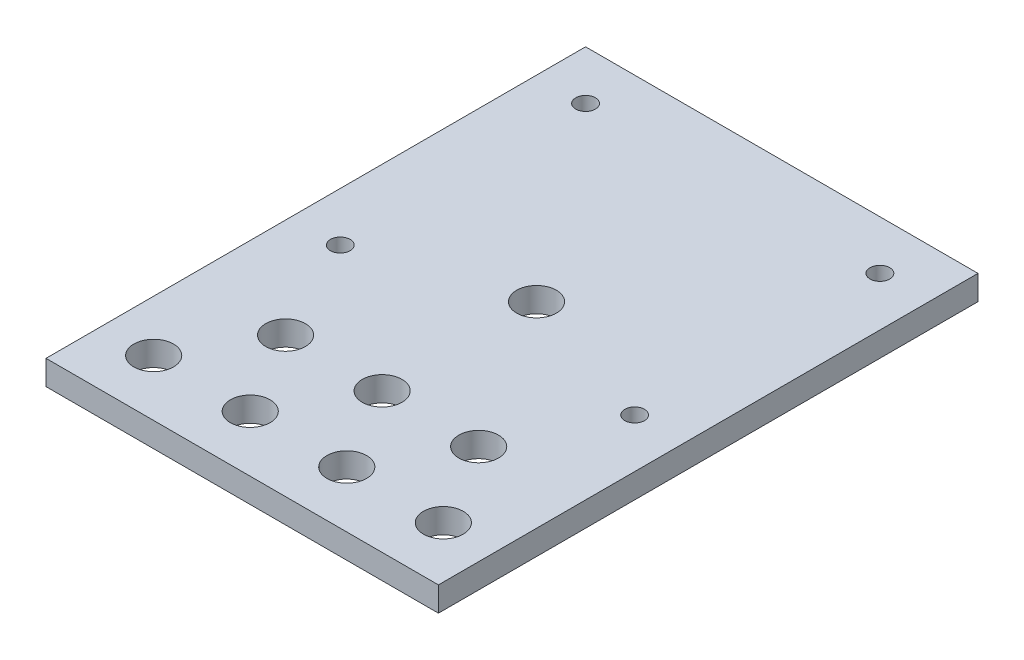
ISO-10303-21;
HEADER;
FILE_DESCRIPTION(('STEP AP214'),'2;1');
FILE_NAME('part.step','',(''),(''),'','','');
FILE_SCHEMA(('AUTOMOTIVE_DESIGN { 1 0 10303 214 1 1 1 1 }'));
ENDSEC;
DATA;
#1=APPLICATION_CONTEXT('core data for automotive mechanical design processes');
#2=APPLICATION_PROTOCOL_DEFINITION('international standard','automotive_design',2000,#1);
#3=PRODUCT_CONTEXT('',#1,'mechanical');
#4=PRODUCT('Part','Part','',(#3));
#5=PRODUCT_RELATED_PRODUCT_CATEGORY('part','',(#4));
#6=PRODUCT_DEFINITION_FORMATION('','',#4);
#7=PRODUCT_DEFINITION_CONTEXT('part definition',#1,'design');
#8=PRODUCT_DEFINITION('design','',#6,#7);
#9=PRODUCT_DEFINITION_SHAPE('','',#8);
#10=(LENGTH_UNIT() NAMED_UNIT(*) SI_UNIT(.MILLI.,.METRE.));
#11=(NAMED_UNIT(*) PLANE_ANGLE_UNIT() SI_UNIT($,.RADIAN.));
#12=(NAMED_UNIT(*) SI_UNIT($,.STERADIAN.) SOLID_ANGLE_UNIT());
#13=UNCERTAINTY_MEASURE_WITH_UNIT(LENGTH_MEASURE(1.E-05),#10,'distance_accuracy_value','');
#14=(GEOMETRIC_REPRESENTATION_CONTEXT(3) GLOBAL_UNCERTAINTY_ASSIGNED_CONTEXT((#13)) GLOBAL_UNIT_ASSIGNED_CONTEXT((#10,
#11,#12)) REPRESENTATION_CONTEXT('',''));
#15=CARTESIAN_POINT('',(0.,0.,0.));
#16=DIRECTION('',(0.,0.,1.));
#17=DIRECTION('',(1.,0.,0.));
#18=AXIS2_PLACEMENT_3D('',#15,#16,#17);
#19=CARTESIAN_POINT('',(0.,6.35,0.));
#20=DIRECTION('',(1.,0.,0.));
#21=DIRECTION('',(0.,0.,-1.));
#22=AXIS2_PLACEMENT_3D('',#19,#20,#21);
#23=PLANE('',#22);
#24=DIRECTION('',(0.,0.,1.));
#25=VECTOR('',#24,1.);
#26=CARTESIAN_POINT('',(0.,0.,0.));
#27=LINE('',#26,#25);
#28=CARTESIAN_POINT('',(0.,0.,-139.7));
#29=VERTEX_POINT('',#28);
#30=CARTESIAN_POINT('',(0.,0.,0.));
#31=VERTEX_POINT('',#30);
#32=EDGE_CURVE('E97',#29,#31,#27,.T.);
#33=ORIENTED_EDGE('',*,*,#32,.T.);
#34=DIRECTION('',(0.,-1.,0.));
#35=VECTOR('',#34,1.);
#36=CARTESIAN_POINT('',(0.,6.35,0.));
#37=LINE('',#36,#35);
#38=CARTESIAN_POINT('',(0.,6.35,0.));
#39=VERTEX_POINT('',#38);
#40=EDGE_CURVE('E11',#39,#31,#37,.T.);
#41=ORIENTED_EDGE('',*,*,#40,.F.);
#42=DIRECTION('',(0.,0.,1.));
#43=VECTOR('',#42,1.);
#44=CARTESIAN_POINT('',(0.,6.35,0.));
#45=LINE('',#44,#43);
#46=CARTESIAN_POINT('',(0.,6.35,-139.7));
#47=VERTEX_POINT('',#46);
#48=EDGE_CURVE('E85',#47,#39,#45,.T.);
#49=ORIENTED_EDGE('',*,*,#48,.F.);
#50=DIRECTION('',(0.,-1.,0.));
#51=VECTOR('',#50,1.);
#52=CARTESIAN_POINT('',(0.,6.35,-139.7));
#53=LINE('',#52,#51);
#54=EDGE_CURVE('E93',#47,#29,#53,.T.);
#55=ORIENTED_EDGE('',*,*,#54,.T.);
#56=EDGE_LOOP('',(#33,#41,#49,#55));
#57=FACE_BOUND('',#56,.T.);
#58=ADVANCED_FACE('F34',(#57),#23,.F.);
#59=CARTESIAN_POINT('',(0.,6.35,0.));
#60=DIRECTION('',(0.,0.,-1.));
#61=DIRECTION('',(-1.,0.,0.));
#62=AXIS2_PLACEMENT_3D('',#59,#60,#61);
#63=PLANE('',#62);
#64=DIRECTION('',(1.,0.,0.));
#65=VECTOR('',#64,1.);
#66=CARTESIAN_POINT('',(0.,0.,0.));
#67=LINE('',#66,#65);
#68=CARTESIAN_POINT('',(101.6,0.,0.));
#69=VERTEX_POINT('',#68);
#70=EDGE_CURVE('E89',#31,#69,#67,.T.);
#71=ORIENTED_EDGE('',*,*,#70,.T.);
#72=DIRECTION('',(0.,-1.,0.));
#73=VECTOR('',#72,1.);
#74=CARTESIAN_POINT('',(101.6,6.35,0.));
#75=LINE('',#74,#73);
#76=CARTESIAN_POINT('',(101.6,6.35,0.));
#77=VERTEX_POINT('',#76);
#78=EDGE_CURVE('E42',#77,#69,#75,.T.);
#79=ORIENTED_EDGE('',*,*,#78,.F.);
#80=DIRECTION('',(1.,0.,0.));
#81=VECTOR('',#80,1.);
#82=CARTESIAN_POINT('',(0.,6.35,0.));
#83=LINE('',#82,#81);
#84=EDGE_CURVE('E80',#39,#77,#83,.T.);
#85=ORIENTED_EDGE('',*,*,#84,.F.);
#86=ORIENTED_EDGE('',*,*,#40,.T.);
#87=EDGE_LOOP('',(#71,#79,#85,#86));
#88=FACE_BOUND('',#87,.T.);
#89=ADVANCED_FACE('F88',(#88),#63,.F.);
#90=CARTESIAN_POINT('',(101.6,6.35,0.));
#91=DIRECTION('',(-1.,0.,0.));
#92=DIRECTION('',(0.,0.,1.));
#93=AXIS2_PLACEMENT_3D('',#90,#91,#92);
#94=PLANE('',#93);
#95=DIRECTION('',(0.,0.,-1.));
#96=VECTOR('',#95,1.);
#97=CARTESIAN_POINT('',(101.6,0.,0.));
#98=LINE('',#97,#96);
#99=CARTESIAN_POINT('',(101.6,0.,-139.7));
#100=VERTEX_POINT('',#99);
#101=EDGE_CURVE('E67',#69,#100,#98,.T.);
#102=ORIENTED_EDGE('',*,*,#101,.T.);
#103=DIRECTION('',(0.,-1.,0.));
#104=VECTOR('',#103,1.);
#105=CARTESIAN_POINT('',(101.6,6.35,-139.7));
#106=LINE('',#105,#104);
#107=CARTESIAN_POINT('',(101.6,6.35,-139.7));
#108=VERTEX_POINT('',#107);
#109=EDGE_CURVE('E90',#108,#100,#106,.T.);
#110=ORIENTED_EDGE('',*,*,#109,.F.);
#111=DIRECTION('',(0.,0.,-1.));
#112=VECTOR('',#111,1.);
#113=CARTESIAN_POINT('',(101.6,6.35,0.));
#114=LINE('',#113,#112);
#115=EDGE_CURVE('E83',#77,#108,#114,.T.);
#116=ORIENTED_EDGE('',*,*,#115,.F.);
#117=ORIENTED_EDGE('',*,*,#78,.T.);
#118=EDGE_LOOP('',(#102,#110,#116,#117));
#119=FACE_BOUND('',#118,.T.);
#120=ADVANCED_FACE('F91',(#119),#94,.F.);
#121=CARTESIAN_POINT('',(0.,6.35,-139.7));
#122=DIRECTION('',(0.,0.,1.));
#123=DIRECTION('',(1.,0.,0.));
#124=AXIS2_PLACEMENT_3D('',#121,#122,#123);
#125=PLANE('',#124);
#126=DIRECTION('',(-1.,0.,0.));
#127=VECTOR('',#126,1.);
#128=CARTESIAN_POINT('',(0.,0.,-139.7));
#129=LINE('',#128,#127);
#130=EDGE_CURVE('E73',#100,#29,#129,.T.);
#131=ORIENTED_EDGE('',*,*,#130,.T.);
#132=ORIENTED_EDGE('',*,*,#54,.F.);
#133=DIRECTION('',(-1.,0.,0.));
#134=VECTOR('',#133,1.);
#135=CARTESIAN_POINT('',(0.,6.35,-139.7));
#136=LINE('',#135,#134);
#137=EDGE_CURVE('E50',#108,#47,#136,.T.);
#138=ORIENTED_EDGE('',*,*,#137,.F.);
#139=ORIENTED_EDGE('',*,*,#109,.T.);
#140=EDGE_LOOP('',(#131,#132,#138,#139));
#141=FACE_BOUND('',#140,.T.);
#142=ADVANCED_FACE('F105',(#141),#125,.F.);
#143=CARTESIAN_POINT('',(0.,6.35,0.));
#144=DIRECTION('',(0.,-1.,0.));
#145=DIRECTION('',(0.,0.,-1.));
#146=AXIS2_PLACEMENT_3D('',#143,#144,#145);
#147=PLANE('',#146);
#148=CARTESIAN_POINT('',(12.7,6.35,-127.));
#149=DIRECTION('',(0.,1.,0.));
#150=DIRECTION('',(0.,0.,1.));
#151=AXIS2_PLACEMENT_3D('',#148,#149,#150);
#152=CIRCLE('',#151,2.55);
#153=CARTESIAN_POINT('',(12.7,6.35,-124.45));
#154=VERTEX_POINT('',#153);
#155=EDGE_CURVE('E141',#154,#154,#152,.T.);
#156=ORIENTED_EDGE('',*,*,#155,.F.);
#157=EDGE_LOOP('',(#156));
#158=FACE_BOUND('',#157,.T.);
#159=CARTESIAN_POINT('',(12.7,6.35,-63.5));
#160=DIRECTION('',(0.,1.,0.));
#161=DIRECTION('',(0.,0.,1.));
#162=AXIS2_PLACEMENT_3D('',#159,#160,#161);
#163=CIRCLE('',#162,2.55);
#164=CARTESIAN_POINT('',(12.7,6.35,-60.95));
#165=VERTEX_POINT('',#164);
#166=EDGE_CURVE('E148',#165,#165,#163,.T.);
#167=ORIENTED_EDGE('',*,*,#166,.F.);
#168=EDGE_LOOP('',(#167));
#169=FACE_BOUND('',#168,.T.);
#170=CARTESIAN_POINT('',(25.8,6.35,-36.2253175473051));
#171=DIRECTION('',(0.,1.,0.));
#172=DIRECTION('',(0.,0.,1.));
#173=AXIS2_PLACEMENT_3D('',#170,#171,#172);
#174=CIRCLE('',#173,5.1435);
#175=CARTESIAN_POINT('',(25.8,6.35,-31.0818175473051));
#176=VERTEX_POINT('',#175);
#177=EDGE_CURVE('E154',#176,#176,#174,.T.);
#178=ORIENTED_EDGE('',*,*,#177,.F.);
#179=EDGE_LOOP('',(#178));
#180=FACE_BOUND('',#179,.T.);
#181=CARTESIAN_POINT('',(50.8,6.35,-36.2253175473055));
#182=DIRECTION('',(0.,1.,0.));
#183=DIRECTION('',(0.,0.,1.));
#184=AXIS2_PLACEMENT_3D('',#181,#182,#183);
#185=CIRCLE('',#184,5.14350000000001);
#186=CARTESIAN_POINT('',(50.8,6.35,-31.0818175473055));
#187=VERTEX_POINT('',#186);
#188=EDGE_CURVE('E160',#187,#187,#185,.T.);
#189=ORIENTED_EDGE('',*,*,#188,.F.);
#190=EDGE_LOOP('',(#189));
#191=FACE_BOUND('',#190,.T.);
#192=CARTESIAN_POINT('',(75.8,6.35,-36.2253175473055));
#193=DIRECTION('',(0.,1.,0.));
#194=DIRECTION('',(0.,0.,1.));
#195=AXIS2_PLACEMENT_3D('',#192,#193,#194);
#196=CIRCLE('',#195,5.1435);
#197=CARTESIAN_POINT('',(75.8,6.35,-31.0818175473055));
#198=VERTEX_POINT('',#197);
#199=EDGE_CURVE('E117',#198,#198,#196,.T.);
#200=ORIENTED_EDGE('',*,*,#199,.F.);
#201=EDGE_LOOP('',(#200));
#202=FACE_BOUND('',#201,.T.);
#203=CARTESIAN_POINT('',(88.3,6.35,-14.5746824526945));
#204=DIRECTION('',(0.,1.,0.));
#205=DIRECTION('',(0.,0.,1.));
#206=AXIS2_PLACEMENT_3D('',#203,#204,#205);
#207=CIRCLE('',#206,5.1435);
#208=CARTESIAN_POINT('',(88.3,6.35,-9.43118245269453));
#209=VERTEX_POINT('',#208);
#210=EDGE_CURVE('E124',#209,#209,#207,.T.);
#211=ORIENTED_EDGE('',*,*,#210,.F.);
#212=EDGE_LOOP('',(#211));
#213=FACE_BOUND('',#212,.T.);
#214=CARTESIAN_POINT('',(63.3,6.35,-14.5746824526945));
#215=DIRECTION('',(0.,1.,0.));
#216=DIRECTION('',(0.,0.,1.));
#217=AXIS2_PLACEMENT_3D('',#214,#215,#216);
#218=CIRCLE('',#217,5.1435);
#219=CARTESIAN_POINT('',(63.3,6.35,-9.43118245269453));
#220=VERTEX_POINT('',#219);
#221=EDGE_CURVE('E130',#220,#220,#218,.T.);
#222=ORIENTED_EDGE('',*,*,#221,.F.);
#223=EDGE_LOOP('',(#222));
#224=FACE_BOUND('',#223,.T.);
#225=CARTESIAN_POINT('',(38.3,6.35,-14.5746824526945));
#226=DIRECTION('',(0.,1.,0.));
#227=DIRECTION('',(0.,0.,1.));
#228=AXIS2_PLACEMENT_3D('',#225,#226,#227);
#229=CIRCLE('',#228,5.14350000000001);
#230=CARTESIAN_POINT('',(38.3,6.35,-9.43118245269452));
#231=VERTEX_POINT('',#230);
#232=EDGE_CURVE('E136',#231,#231,#229,.T.);
#233=ORIENTED_EDGE('',*,*,#232,.F.);
#234=EDGE_LOOP('',(#233));
#235=FACE_BOUND('',#234,.T.);
#236=CARTESIAN_POINT('',(88.9,6.35,-63.5));
#237=DIRECTION('',(0.,1.,0.));
#238=DIRECTION('',(0.,0.,1.));
#239=AXIS2_PLACEMENT_3D('',#236,#237,#238);
#240=CIRCLE('',#239,2.54999999999999);
#241=CARTESIAN_POINT('',(88.9,6.35,-60.95));
#242=VERTEX_POINT('',#241);
#243=EDGE_CURVE('E177',#242,#242,#240,.T.);
#244=ORIENTED_EDGE('',*,*,#243,.F.);
#245=EDGE_LOOP('',(#244));
#246=FACE_BOUND('',#245,.T.);
#247=CARTESIAN_POINT('',(88.9,6.35,-127.));
#248=DIRECTION('',(0.,1.,0.));
#249=DIRECTION('',(0.,0.,1.));
#250=AXIS2_PLACEMENT_3D('',#247,#248,#249);
#251=CIRCLE('',#250,2.54999999999999);
#252=CARTESIAN_POINT('',(88.9,6.35,-124.45));
#253=VERTEX_POINT('',#252);
#254=EDGE_CURVE('E171',#253,#253,#251,.T.);
#255=ORIENTED_EDGE('',*,*,#254,.F.);
#256=EDGE_LOOP('',(#255));
#257=FACE_BOUND('',#256,.T.);
#258=CARTESIAN_POINT('',(50.8,6.35,-76.1999999999997));
#259=DIRECTION('',(0.,1.,0.));
#260=DIRECTION('',(0.,0.,1.));
#261=AXIS2_PLACEMENT_3D('',#258,#259,#260);
#262=CIRCLE('',#261,5.14350000000008);
#263=CARTESIAN_POINT('',(50.8,6.35,-71.0564999999997));
#264=VERTEX_POINT('',#263);
#265=EDGE_CURVE('E165',#264,#264,#262,.T.);
#266=ORIENTED_EDGE('',*,*,#265,.F.);
#267=EDGE_LOOP('',(#266));
#268=FACE_BOUND('',#267,.T.);
#269=CARTESIAN_POINT('',(13.3,6.35,-14.5746824526945));
#270=DIRECTION('',(0.,1.,0.));
#271=DIRECTION('',(0.,0.,1.));
#272=AXIS2_PLACEMENT_3D('',#269,#270,#271);
#273=CIRCLE('',#272,5.1435);
#274=CARTESIAN_POINT('',(13.3,6.35,-9.43118245269452));
#275=VERTEX_POINT('',#274);
#276=EDGE_CURVE('E111',#275,#275,#273,.T.);
#277=ORIENTED_EDGE('',*,*,#276,.F.);
#278=EDGE_LOOP('',(#277));
#279=FACE_BOUND('',#278,.T.);
#280=ORIENTED_EDGE('',*,*,#48,.T.);
#281=ORIENTED_EDGE('',*,*,#84,.T.);
#282=ORIENTED_EDGE('',*,*,#115,.T.);
#283=ORIENTED_EDGE('',*,*,#137,.T.);
#284=EDGE_LOOP('',(#280,#281,#282,#283));
#285=FACE_BOUND('',#284,.T.);
#286=ADVANCED_FACE('F81',(#158,#169,#180,#191,#202,#213,#224,#235,#246,#257,#268,#279,#285),
#147,.F.);
#287=CARTESIAN_POINT('',(0.,0.,0.));
#288=DIRECTION('',(0.,-1.,0.));
#289=DIRECTION('',(0.,0.,-1.));
#290=AXIS2_PLACEMENT_3D('',#287,#288,#289);
#291=PLANE('',#290);
#292=CARTESIAN_POINT('',(12.7,0.,-127.));
#293=DIRECTION('',(0.,1.,0.));
#294=DIRECTION('',(0.,0.,1.));
#295=AXIS2_PLACEMENT_3D('',#292,#293,#294);
#296=CIRCLE('',#295,2.55);
#297=CARTESIAN_POINT('',(12.7,0.,-124.45));
#298=VERTEX_POINT('',#297);
#299=EDGE_CURVE('E144',#298,#298,#296,.T.);
#300=ORIENTED_EDGE('',*,*,#299,.T.);
#301=EDGE_LOOP('',(#300));
#302=FACE_BOUND('',#301,.T.);
#303=CARTESIAN_POINT('',(12.7,0.,-63.5));
#304=DIRECTION('',(0.,1.,0.));
#305=DIRECTION('',(0.,0.,1.));
#306=AXIS2_PLACEMENT_3D('',#303,#304,#305);
#307=CIRCLE('',#306,2.55);
#308=CARTESIAN_POINT('',(12.7,0.,-60.95));
#309=VERTEX_POINT('',#308);
#310=EDGE_CURVE('E151',#309,#309,#307,.T.);
#311=ORIENTED_EDGE('',*,*,#310,.T.);
#312=EDGE_LOOP('',(#311));
#313=FACE_BOUND('',#312,.T.);
#314=CARTESIAN_POINT('',(25.8,0.,-36.2253175473051));
#315=DIRECTION('',(0.,1.,0.));
#316=DIRECTION('',(0.,0.,1.));
#317=AXIS2_PLACEMENT_3D('',#314,#315,#316);
#318=CIRCLE('',#317,5.1435);
#319=CARTESIAN_POINT('',(25.8,0.,-31.0818175473051));
#320=VERTEX_POINT('',#319);
#321=EDGE_CURVE('E157',#320,#320,#318,.T.);
#322=ORIENTED_EDGE('',*,*,#321,.T.);
#323=EDGE_LOOP('',(#322));
#324=FACE_BOUND('',#323,.T.);
#325=CARTESIAN_POINT('',(50.8,0.,-36.2253175473055));
#326=DIRECTION('',(0.,1.,0.));
#327=DIRECTION('',(0.,0.,1.));
#328=AXIS2_PLACEMENT_3D('',#325,#326,#327);
#329=CIRCLE('',#328,5.14350000000001);
#330=CARTESIAN_POINT('',(50.8,0.,-31.0818175473055));
#331=VERTEX_POINT('',#330);
#332=EDGE_CURVE('E121',#331,#331,#329,.T.);
#333=ORIENTED_EDGE('',*,*,#332,.T.);
#334=EDGE_LOOP('',(#333));
#335=FACE_BOUND('',#334,.T.);
#336=CARTESIAN_POINT('',(75.8,0.,-36.2253175473055));
#337=DIRECTION('',(0.,1.,0.));
#338=DIRECTION('',(0.,0.,1.));
#339=AXIS2_PLACEMENT_3D('',#336,#337,#338);
#340=CIRCLE('',#339,5.1435);
#341=CARTESIAN_POINT('',(75.8,0.,-31.0818175473055));
#342=VERTEX_POINT('',#341);
#343=EDGE_CURVE('E120',#342,#342,#340,.T.);
#344=ORIENTED_EDGE('',*,*,#343,.T.);
#345=EDGE_LOOP('',(#344));
#346=FACE_BOUND('',#345,.T.);
#347=CARTESIAN_POINT('',(88.3,0.,-14.5746824526945));
#348=DIRECTION('',(0.,1.,0.));
#349=DIRECTION('',(0.,0.,1.));
#350=AXIS2_PLACEMENT_3D('',#347,#348,#349);
#351=CIRCLE('',#350,5.1435);
#352=CARTESIAN_POINT('',(88.3,0.,-9.43118245269453));
#353=VERTEX_POINT('',#352);
#354=EDGE_CURVE('E127',#353,#353,#351,.T.);
#355=ORIENTED_EDGE('',*,*,#354,.T.);
#356=EDGE_LOOP('',(#355));
#357=FACE_BOUND('',#356,.T.);
#358=CARTESIAN_POINT('',(63.3,0.,-14.5746824526945));
#359=DIRECTION('',(0.,1.,0.));
#360=DIRECTION('',(0.,0.,1.));
#361=AXIS2_PLACEMENT_3D('',#358,#359,#360);
#362=CIRCLE('',#361,5.1435);
#363=CARTESIAN_POINT('',(63.3,0.,-9.43118245269453));
#364=VERTEX_POINT('',#363);
#365=EDGE_CURVE('E133',#364,#364,#362,.T.);
#366=ORIENTED_EDGE('',*,*,#365,.T.);
#367=EDGE_LOOP('',(#366));
#368=FACE_BOUND('',#367,.T.);
#369=CARTESIAN_POINT('',(38.3,0.,-14.5746824526945));
#370=DIRECTION('',(0.,1.,0.));
#371=DIRECTION('',(0.,0.,1.));
#372=AXIS2_PLACEMENT_3D('',#369,#370,#371);
#373=CIRCLE('',#372,5.14350000000001);
#374=CARTESIAN_POINT('',(38.3,0.,-9.43118245269452));
#375=VERTEX_POINT('',#374);
#376=EDGE_CURVE('E114',#375,#375,#373,.T.);
#377=ORIENTED_EDGE('',*,*,#376,.T.);
#378=EDGE_LOOP('',(#377));
#379=FACE_BOUND('',#378,.T.);
#380=CARTESIAN_POINT('',(88.9,0.,-63.5));
#381=DIRECTION('',(0.,1.,0.));
#382=DIRECTION('',(0.,0.,1.));
#383=AXIS2_PLACEMENT_3D('',#380,#381,#382);
#384=CIRCLE('',#383,2.54999999999999);
#385=CARTESIAN_POINT('',(88.9,0.,-60.95));
#386=VERTEX_POINT('',#385);
#387=EDGE_CURVE('E145',#386,#386,#384,.T.);
#388=ORIENTED_EDGE('',*,*,#387,.T.);
#389=EDGE_LOOP('',(#388));
#390=FACE_BOUND('',#389,.T.);
#391=CARTESIAN_POINT('',(88.9,0.,-127.));
#392=DIRECTION('',(0.,1.,0.));
#393=DIRECTION('',(0.,0.,1.));
#394=AXIS2_PLACEMENT_3D('',#391,#392,#393);
#395=CIRCLE('',#394,2.54999999999999);
#396=CARTESIAN_POINT('',(88.9,0.,-124.45));
#397=VERTEX_POINT('',#396);
#398=EDGE_CURVE('E174',#397,#397,#395,.T.);
#399=ORIENTED_EDGE('',*,*,#398,.T.);
#400=EDGE_LOOP('',(#399));
#401=FACE_BOUND('',#400,.T.);
#402=CARTESIAN_POINT('',(50.8,0.,-76.1999999999997));
#403=DIRECTION('',(0.,1.,0.));
#404=DIRECTION('',(0.,0.,1.));
#405=AXIS2_PLACEMENT_3D('',#402,#403,#404);
#406=CIRCLE('',#405,5.14350000000008);
#407=CARTESIAN_POINT('',(50.8,0.,-71.0564999999997));
#408=VERTEX_POINT('',#407);
#409=EDGE_CURVE('E168',#408,#408,#406,.T.);
#410=ORIENTED_EDGE('',*,*,#409,.T.);
#411=EDGE_LOOP('',(#410));
#412=FACE_BOUND('',#411,.T.);
#413=CARTESIAN_POINT('',(13.3,0.,-14.5746824526945));
#414=DIRECTION('',(0.,1.,0.));
#415=DIRECTION('',(0.,0.,1.));
#416=AXIS2_PLACEMENT_3D('',#413,#414,#415);
#417=CIRCLE('',#416,5.1435);
#418=CARTESIAN_POINT('',(13.3,0.,-9.43118245269452));
#419=VERTEX_POINT('',#418);
#420=EDGE_CURVE('E100',#419,#419,#417,.T.);
#421=ORIENTED_EDGE('',*,*,#420,.T.);
#422=EDGE_LOOP('',(#421));
#423=FACE_BOUND('',#422,.T.);
#424=ORIENTED_EDGE('',*,*,#32,.F.);
#425=ORIENTED_EDGE('',*,*,#130,.F.);
#426=ORIENTED_EDGE('',*,*,#101,.F.);
#427=ORIENTED_EDGE('',*,*,#70,.F.);
#428=EDGE_LOOP('',(#424,#425,#426,#427));
#429=FACE_BOUND('',#428,.T.);
#430=ADVANCED_FACE('F108',(#302,#313,#324,#335,#346,#357,#368,#379,#390,#401,#412,#423,#429),
#291,.T.);
#431=CARTESIAN_POINT('',(13.3,0.,-14.5746824526945));
#432=DIRECTION('',(0.,1.,0.));
#433=DIRECTION('',(0.,0.,1.));
#434=AXIS2_PLACEMENT_3D('',#431,#432,#433);
#435=CYLINDRICAL_SURFACE('',#434,5.1435);
#436=ORIENTED_EDGE('',*,*,#420,.F.);
#437=EDGE_LOOP('',(#436));
#438=FACE_BOUND('',#437,.T.);
#439=ORIENTED_EDGE('',*,*,#276,.T.);
#440=EDGE_LOOP('',(#439));
#441=FACE_BOUND('',#440,.T.);
#442=ADVANCED_FACE('F203',(#438,#441),#435,.F.);
#443=CARTESIAN_POINT('',(50.8,0.,-76.1999999999997));
#444=DIRECTION('',(0.,1.,0.));
#445=DIRECTION('',(0.,0.,1.));
#446=AXIS2_PLACEMENT_3D('',#443,#444,#445);
#447=CYLINDRICAL_SURFACE('',#446,5.14350000000008);
#448=ORIENTED_EDGE('',*,*,#409,.F.);
#449=EDGE_LOOP('',(#448));
#450=FACE_BOUND('',#449,.T.);
#451=ORIENTED_EDGE('',*,*,#265,.T.);
#452=EDGE_LOOP('',(#451));
#453=FACE_BOUND('',#452,.T.);
#454=ADVANCED_FACE('F205',(#450,#453),#447,.F.);
#455=CARTESIAN_POINT('',(88.9,0.,-127.));
#456=DIRECTION('',(0.,1.,0.));
#457=DIRECTION('',(0.,0.,1.));
#458=AXIS2_PLACEMENT_3D('',#455,#456,#457);
#459=CYLINDRICAL_SURFACE('',#458,2.54999999999999);
#460=ORIENTED_EDGE('',*,*,#398,.F.);
#461=EDGE_LOOP('',(#460));
#462=FACE_BOUND('',#461,.T.);
#463=ORIENTED_EDGE('',*,*,#254,.T.);
#464=EDGE_LOOP('',(#463));
#465=FACE_BOUND('',#464,.T.);
#466=ADVANCED_FACE('F189',(#462,#465),#459,.F.);
#467=CARTESIAN_POINT('',(88.9,0.,-63.5));
#468=DIRECTION('',(0.,1.,0.));
#469=DIRECTION('',(0.,0.,1.));
#470=AXIS2_PLACEMENT_3D('',#467,#468,#469);
#471=CYLINDRICAL_SURFACE('',#470,2.54999999999999);
#472=ORIENTED_EDGE('',*,*,#387,.F.);
#473=EDGE_LOOP('',(#472));
#474=FACE_BOUND('',#473,.T.);
#475=ORIENTED_EDGE('',*,*,#243,.T.);
#476=EDGE_LOOP('',(#475));
#477=FACE_BOUND('',#476,.T.);
#478=ADVANCED_FACE('F185',(#474,#477),#471,.F.);
#479=CARTESIAN_POINT('',(38.3,0.,-14.5746824526945));
#480=DIRECTION('',(0.,1.,0.));
#481=DIRECTION('',(0.,0.,1.));
#482=AXIS2_PLACEMENT_3D('',#479,#480,#481);
#483=CYLINDRICAL_SURFACE('',#482,5.14350000000001);
#484=ORIENTED_EDGE('',*,*,#376,.F.);
#485=EDGE_LOOP('',(#484));
#486=FACE_BOUND('',#485,.T.);
#487=ORIENTED_EDGE('',*,*,#232,.T.);
#488=EDGE_LOOP('',(#487));
#489=FACE_BOUND('',#488,.T.);
#490=ADVANCED_FACE('F188',(#486,#489),#483,.F.);
#491=CARTESIAN_POINT('',(63.3,0.,-14.5746824526945));
#492=DIRECTION('',(0.,1.,0.));
#493=DIRECTION('',(0.,0.,1.));
#494=AXIS2_PLACEMENT_3D('',#491,#492,#493);
#495=CYLINDRICAL_SURFACE('',#494,5.1435);
#496=ORIENTED_EDGE('',*,*,#365,.F.);
#497=EDGE_LOOP('',(#496));
#498=FACE_BOUND('',#497,.T.);
#499=ORIENTED_EDGE('',*,*,#221,.T.);
#500=EDGE_LOOP('',(#499));
#501=FACE_BOUND('',#500,.T.);
#502=ADVANCED_FACE('F274',(#498,#501),#495,.F.);
#503=CARTESIAN_POINT('',(88.3,0.,-14.5746824526945));
#504=DIRECTION('',(0.,1.,0.));
#505=DIRECTION('',(0.,0.,1.));
#506=AXIS2_PLACEMENT_3D('',#503,#504,#505);
#507=CYLINDRICAL_SURFACE('',#506,5.1435);
#508=ORIENTED_EDGE('',*,*,#354,.F.);
#509=EDGE_LOOP('',(#508));
#510=FACE_BOUND('',#509,.T.);
#511=ORIENTED_EDGE('',*,*,#210,.T.);
#512=EDGE_LOOP('',(#511));
#513=FACE_BOUND('',#512,.T.);
#514=ADVANCED_FACE('F284',(#510,#513),#507,.F.);
#515=CARTESIAN_POINT('',(75.8,0.,-36.2253175473055));
#516=DIRECTION('',(0.,1.,0.));
#517=DIRECTION('',(0.,0.,1.));
#518=AXIS2_PLACEMENT_3D('',#515,#516,#517);
#519=CYLINDRICAL_SURFACE('',#518,5.1435);
#520=ORIENTED_EDGE('',*,*,#343,.F.);
#521=EDGE_LOOP('',(#520));
#522=FACE_BOUND('',#521,.T.);
#523=ORIENTED_EDGE('',*,*,#199,.T.);
#524=EDGE_LOOP('',(#523));
#525=FACE_BOUND('',#524,.T.);
#526=ADVANCED_FACE('F294',(#522,#525),#519,.F.);
#527=CARTESIAN_POINT('',(50.8,0.,-36.2253175473055));
#528=DIRECTION('',(0.,1.,0.));
#529=DIRECTION('',(0.,0.,1.));
#530=AXIS2_PLACEMENT_3D('',#527,#528,#529);
#531=CYLINDRICAL_SURFACE('',#530,5.14350000000001);
#532=ORIENTED_EDGE('',*,*,#332,.F.);
#533=EDGE_LOOP('',(#532));
#534=FACE_BOUND('',#533,.T.);
#535=ORIENTED_EDGE('',*,*,#188,.T.);
#536=EDGE_LOOP('',(#535));
#537=FACE_BOUND('',#536,.T.);
#538=ADVANCED_FACE('F304',(#534,#537),#531,.F.);
#539=CARTESIAN_POINT('',(25.8,0.,-36.2253175473051));
#540=DIRECTION('',(0.,1.,0.));
#541=DIRECTION('',(0.,0.,1.));
#542=AXIS2_PLACEMENT_3D('',#539,#540,#541);
#543=CYLINDRICAL_SURFACE('',#542,5.1435);
#544=ORIENTED_EDGE('',*,*,#321,.F.);
#545=EDGE_LOOP('',(#544));
#546=FACE_BOUND('',#545,.T.);
#547=ORIENTED_EDGE('',*,*,#177,.T.);
#548=EDGE_LOOP('',(#547));
#549=FACE_BOUND('',#548,.T.);
#550=ADVANCED_FACE('F313',(#546,#549),#543,.F.);
#551=CARTESIAN_POINT('',(12.7,0.,-63.5));
#552=DIRECTION('',(0.,1.,0.));
#553=DIRECTION('',(0.,0.,1.));
#554=AXIS2_PLACEMENT_3D('',#551,#552,#553);
#555=CYLINDRICAL_SURFACE('',#554,2.55);
#556=ORIENTED_EDGE('',*,*,#310,.F.);
#557=EDGE_LOOP('',(#556));
#558=FACE_BOUND('',#557,.T.);
#559=ORIENTED_EDGE('',*,*,#166,.T.);
#560=EDGE_LOOP('',(#559));
#561=FACE_BOUND('',#560,.T.);
#562=ADVANCED_FACE('F323',(#558,#561),#555,.F.);
#563=CARTESIAN_POINT('',(12.7,0.,-127.));
#564=DIRECTION('',(0.,1.,0.));
#565=DIRECTION('',(0.,0.,1.));
#566=AXIS2_PLACEMENT_3D('',#563,#564,#565);
#567=CYLINDRICAL_SURFACE('',#566,2.55);
#568=ORIENTED_EDGE('',*,*,#299,.F.);
#569=EDGE_LOOP('',(#568));
#570=FACE_BOUND('',#569,.T.);
#571=ORIENTED_EDGE('',*,*,#155,.T.);
#572=EDGE_LOOP('',(#571));
#573=FACE_BOUND('',#572,.T.);
#574=ADVANCED_FACE('F333',(#570,#573),#567,.F.);
#575=CLOSED_SHELL('',(#58,#89,#120,#142,#286,#430,#442,#454,#466,#478,#490,#502,#514,#526,#538,
#550,#562,#574));
#576=MANIFOLD_SOLID_BREP('B2',#575);
#577=ADVANCED_BREP_SHAPE_REPRESENTATION('',(#18,#576),#14);
#578=SHAPE_DEFINITION_REPRESENTATION(#9,#577);
ENDSEC;
END-ISO-10303-21;
